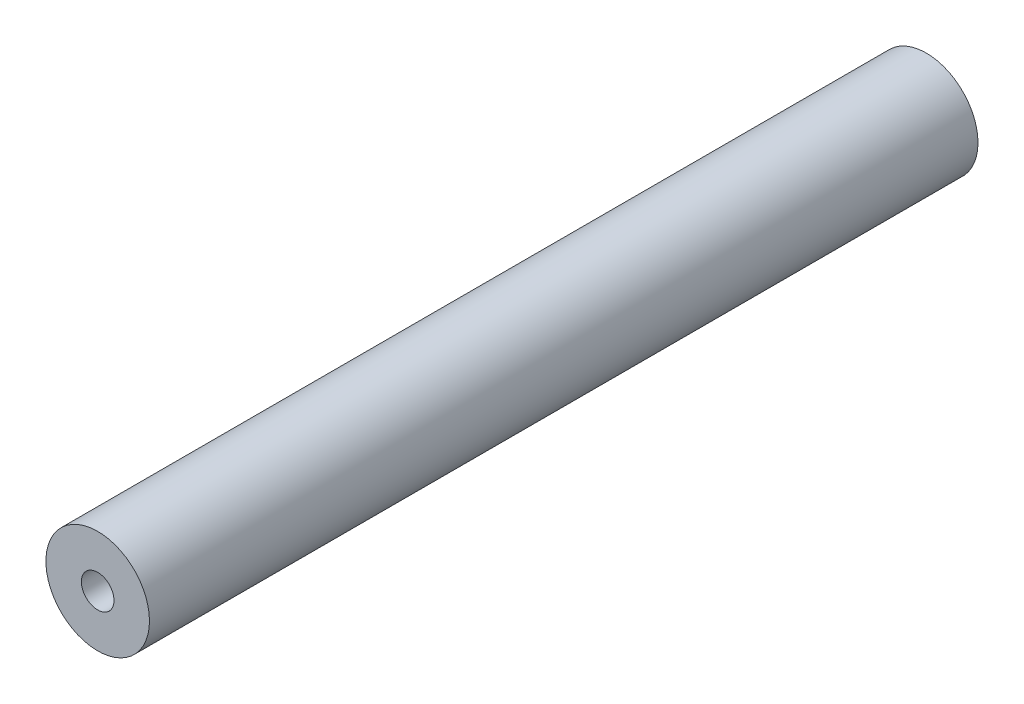
ISO-10303-21;
HEADER;
FILE_DESCRIPTION(('STEP AP214'),'2;1');
FILE_NAME('part.step','',(''),(''),'','','');
FILE_SCHEMA(('AUTOMOTIVE_DESIGN { 1 0 10303 214 1 1 1 1 }'));
ENDSEC;
DATA;
#1=APPLICATION_CONTEXT('core data for automotive mechanical design processes');
#2=APPLICATION_PROTOCOL_DEFINITION('international standard','automotive_design',2000,#1);
#3=PRODUCT_CONTEXT('',#1,'mechanical');
#4=PRODUCT('Part','Part','',(#3));
#5=PRODUCT_RELATED_PRODUCT_CATEGORY('part','',(#4));
#6=PRODUCT_DEFINITION_FORMATION('','',#4);
#7=PRODUCT_DEFINITION_CONTEXT('part definition',#1,'design');
#8=PRODUCT_DEFINITION('design','',#6,#7);
#9=PRODUCT_DEFINITION_SHAPE('','',#8);
#10=(LENGTH_UNIT() NAMED_UNIT(*) SI_UNIT(.MILLI.,.METRE.));
#11=(NAMED_UNIT(*) PLANE_ANGLE_UNIT() SI_UNIT($,.RADIAN.));
#12=(NAMED_UNIT(*) SI_UNIT($,.STERADIAN.) SOLID_ANGLE_UNIT());
#13=UNCERTAINTY_MEASURE_WITH_UNIT(LENGTH_MEASURE(1.E-05),#10,'distance_accuracy_value','');
#14=(GEOMETRIC_REPRESENTATION_CONTEXT(3) GLOBAL_UNCERTAINTY_ASSIGNED_CONTEXT((#13)) GLOBAL_UNIT_ASSIGNED_CONTEXT((#10,
#11,#12)) REPRESENTATION_CONTEXT('',''));
#15=CARTESIAN_POINT('',(0.,0.,0.));
#16=DIRECTION('',(0.,0.,1.));
#17=DIRECTION('',(1.,0.,0.));
#18=AXIS2_PLACEMENT_3D('',#15,#16,#17);
#19=CARTESIAN_POINT('',(0.,0.,101.6));
#20=DIRECTION('',(0.,0.,-1.));
#21=DIRECTION('',(-1.,0.,0.));
#22=AXIS2_PLACEMENT_3D('',#19,#20,#21);
#23=CYLINDRICAL_SURFACE('',#22,6.35);
#24=CARTESIAN_POINT('',(0.,0.,101.6));
#25=DIRECTION('',(0.,0.,1.));
#26=DIRECTION('',(1.,0.,0.));
#27=AXIS2_PLACEMENT_3D('',#24,#25,#26);
#28=CIRCLE('',#27,6.35);
#29=CARTESIAN_POINT('',(6.35,0.,101.6));
#30=VERTEX_POINT('',#29);
#31=EDGE_CURVE('E10',#30,#30,#28,.T.);
#32=ORIENTED_EDGE('',*,*,#31,.F.);
#33=EDGE_LOOP('',(#32));
#34=FACE_BOUND('',#33,.T.);
#35=CARTESIAN_POINT('',(0.,0.,0.));
#36=DIRECTION('',(0.,0.,1.));
#37=DIRECTION('',(1.,0.,0.));
#38=AXIS2_PLACEMENT_3D('',#35,#36,#37);
#39=CIRCLE('',#38,6.35);
#40=CARTESIAN_POINT('',(6.35,0.,0.));
#41=VERTEX_POINT('',#40);
#42=EDGE_CURVE('E40',#41,#41,#39,.T.);
#43=ORIENTED_EDGE('',*,*,#42,.T.);
#44=EDGE_LOOP('',(#43));
#45=FACE_BOUND('',#44,.T.);
#46=ADVANCED_FACE('F37',(#34,#45),#23,.T.);
#47=CARTESIAN_POINT('',(0.,0.,101.6));
#48=DIRECTION('',(0.,0.,1.));
#49=DIRECTION('',(1.,0.,0.));
#50=AXIS2_PLACEMENT_3D('',#47,#48,#49);
#51=PLANE('',#50);
#52=CARTESIAN_POINT('',(0.,0.,101.6));
#53=DIRECTION('',(0.,0.,1.));
#54=DIRECTION('',(1.,0.,0.));
#55=AXIS2_PLACEMENT_3D('',#52,#53,#54);
#56=CIRCLE('',#55,2.);
#57=CARTESIAN_POINT('',(2.,0.,101.6));
#58=VERTEX_POINT('',#57);
#59=EDGE_CURVE('E51',#58,#58,#56,.T.);
#60=ORIENTED_EDGE('',*,*,#59,.F.);
#61=EDGE_LOOP('',(#60));
#62=FACE_BOUND('',#61,.T.);
#63=ORIENTED_EDGE('',*,*,#31,.T.);
#64=EDGE_LOOP('',(#63));
#65=FACE_BOUND('',#64,.T.);
#66=ADVANCED_FACE('F68',(#62,#65),#51,.T.);
#67=CARTESIAN_POINT('',(0.,0.,0.));
#68=DIRECTION('',(0.,0.,1.));
#69=DIRECTION('',(1.,0.,0.));
#70=AXIS2_PLACEMENT_3D('',#67,#68,#69);
#71=PLANE('',#70);
#72=CARTESIAN_POINT('',(0.,0.,0.));
#73=DIRECTION('',(0.,0.,1.));
#74=DIRECTION('',(1.,0.,0.));
#75=AXIS2_PLACEMENT_3D('',#72,#73,#74);
#76=CIRCLE('',#75,2.);
#77=CARTESIAN_POINT('',(2.,0.,0.));
#78=VERTEX_POINT('',#77);
#79=EDGE_CURVE('E49',#78,#78,#76,.T.);
#80=ORIENTED_EDGE('',*,*,#79,.T.);
#81=EDGE_LOOP('',(#80));
#82=FACE_BOUND('',#81,.T.);
#83=ORIENTED_EDGE('',*,*,#42,.F.);
#84=EDGE_LOOP('',(#83));
#85=FACE_BOUND('',#84,.T.);
#86=ADVANCED_FACE('F59',(#82,#85),#71,.F.);
#87=CARTESIAN_POINT('',(0.,0.,0.));
#88=DIRECTION('',(0.,0.,1.));
#89=DIRECTION('',(1.,0.,0.));
#90=AXIS2_PLACEMENT_3D('',#87,#88,#89);
#91=CYLINDRICAL_SURFACE('',#90,2.);
#92=ORIENTED_EDGE('',*,*,#79,.F.);
#93=EDGE_LOOP('',(#92));
#94=FACE_BOUND('',#93,.T.);
#95=ORIENTED_EDGE('',*,*,#59,.T.);
#96=EDGE_LOOP('',(#95));
#97=FACE_BOUND('',#96,.T.);
#98=ADVANCED_FACE('F62',(#94,#97),#91,.F.);
#99=CLOSED_SHELL('',(#46,#66,#86,#98));
#100=MANIFOLD_SOLID_BREP('B2',#99);
#101=ADVANCED_BREP_SHAPE_REPRESENTATION('',(#18,#100),#14);
#102=SHAPE_DEFINITION_REPRESENTATION(#9,#101);
ENDSEC;
END-ISO-10303-21;
